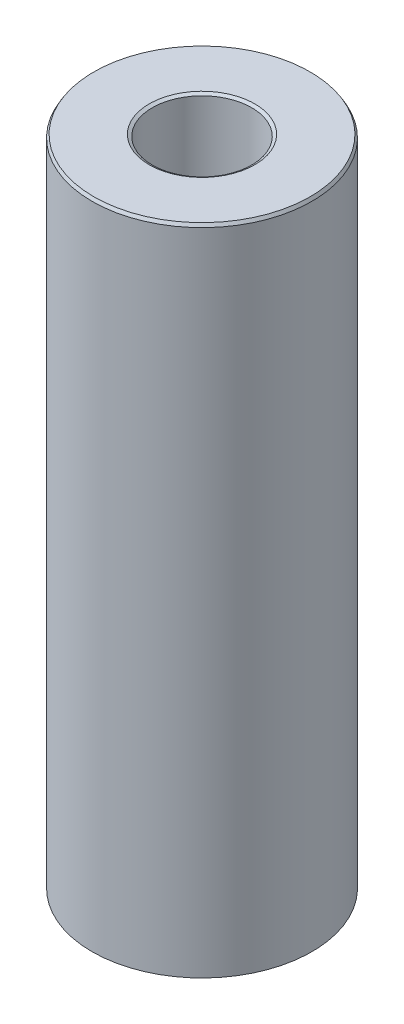
ISO-10303-21;
HEADER;
FILE_DESCRIPTION(('STEP AP214'),'2;1');
FILE_NAME('part.step','',(''),(''),'','','');
FILE_SCHEMA(('AUTOMOTIVE_DESIGN { 1 0 10303 214 1 1 1 1 }'));
ENDSEC;
DATA;
#1=APPLICATION_CONTEXT('core data for automotive mechanical design processes');
#2=APPLICATION_PROTOCOL_DEFINITION('international standard','automotive_design',2000,#1);
#3=PRODUCT_CONTEXT('',#1,'mechanical');
#4=PRODUCT('Part','Part','',(#3));
#5=PRODUCT_RELATED_PRODUCT_CATEGORY('part','',(#4));
#6=PRODUCT_DEFINITION_FORMATION('','',#4);
#7=PRODUCT_DEFINITION_CONTEXT('part definition',#1,'design');
#8=PRODUCT_DEFINITION('design','',#6,#7);
#9=PRODUCT_DEFINITION_SHAPE('','',#8);
#10=(LENGTH_UNIT() NAMED_UNIT(*) SI_UNIT(.MILLI.,.METRE.));
#11=(NAMED_UNIT(*) PLANE_ANGLE_UNIT() SI_UNIT($,.RADIAN.));
#12=(NAMED_UNIT(*) SI_UNIT($,.STERADIAN.) SOLID_ANGLE_UNIT());
#13=UNCERTAINTY_MEASURE_WITH_UNIT(LENGTH_MEASURE(1.E-05),#10,'distance_accuracy_value','');
#14=(GEOMETRIC_REPRESENTATION_CONTEXT(3) GLOBAL_UNCERTAINTY_ASSIGNED_CONTEXT((#13)) GLOBAL_UNIT_ASSIGNED_CONTEXT((#10,
#11,#12)) REPRESENTATION_CONTEXT('',''));
#15=CARTESIAN_POINT('',(0.,0.,0.));
#16=DIRECTION('',(0.,0.,1.));
#17=DIRECTION('',(1.,0.,0.));
#18=AXIS2_PLACEMENT_3D('',#15,#16,#17);
#19=CARTESIAN_POINT('',(0.,74.4313332997931,0.));
#20=DIRECTION('',(0.,-1.,0.));
#21=DIRECTION('',(0.,0.,-1.));
#22=AXIS2_PLACEMENT_3D('',#19,#20,#21);
#23=CYLINDRICAL_SURFACE('',#22,12.5);
#24=CARTESIAN_POINT('',(0.,0.202127398570007,0.));
#25=DIRECTION('',(0.,1.,0.));
#26=DIRECTION('',(0.,0.,1.));
#27=AXIS2_PLACEMENT_3D('',#24,#25,#26);
#28=CIRCLE('',#27,12.5);
#29=CARTESIAN_POINT('',(0.,0.202127398570007,12.5));
#30=VERTEX_POINT('',#29);
#31=EDGE_CURVE('E10',#30,#30,#28,.T.);
#32=ORIENTED_EDGE('',*,*,#31,.T.);
#33=EDGE_LOOP('',(#32));
#34=FACE_BOUND('',#33,.T.);
#35=CARTESIAN_POINT('',(0.,74.0812383758682,0.));
#36=DIRECTION('',(0.,1.,0.));
#37=DIRECTION('',(0.,0.,1.));
#38=AXIS2_PLACEMENT_3D('',#35,#36,#37);
#39=CIRCLE('',#38,12.5);
#40=CARTESIAN_POINT('',(0.,74.0812383758682,12.5));
#41=VERTEX_POINT('',#40);
#42=EDGE_CURVE('E50',#41,#41,#39,.F.);
#43=ORIENTED_EDGE('',*,*,#42,.T.);
#44=EDGE_LOOP('',(#43));
#45=FACE_BOUND('',#44,.T.);
#46=ADVANCED_FACE('F39',(#34,#45),#23,.T.);
#47=CARTESIAN_POINT('',(0.,74.4313332997931,0.));
#48=DIRECTION('',(0.,1.,0.));
#49=DIRECTION('',(0.,0.,1.));
#50=AXIS2_PLACEMENT_3D('',#47,#48,#49);
#51=PLANE('',#50);
#52=CARTESIAN_POINT('',(0.,74.4313332997931,0.));
#53=DIRECTION('',(0.,1.,0.));
#54=DIRECTION('',(0.,0.,1.));
#55=AXIS2_PLACEMENT_3D('',#52,#53,#54);
#56=CIRCLE('',#55,6.00171155576419);
#57=CARTESIAN_POINT('',(0.,74.4313332997931,6.00171155576419));
#58=VERTEX_POINT('',#57);
#59=EDGE_CURVE('E58',#58,#58,#56,.F.);
#60=ORIENTED_EDGE('',*,*,#59,.T.);
#61=EDGE_LOOP('',(#60));
#62=FACE_BOUND('',#61,.T.);
#63=CARTESIAN_POINT('',(0.,74.4313332997931,0.));
#64=DIRECTION('',(0.,1.,0.));
#65=DIRECTION('',(0.,0.,1.));
#66=AXIS2_PLACEMENT_3D('',#63,#64,#65);
#67=CIRCLE('',#66,12.29787260143);
#68=CARTESIAN_POINT('',(0.,74.4313332997931,12.29787260143));
#69=VERTEX_POINT('',#68);
#70=EDGE_CURVE('E61',#69,#69,#67,.T.);
#71=ORIENTED_EDGE('',*,*,#70,.T.);
#72=EDGE_LOOP('',(#71));
#73=FACE_BOUND('',#72,.T.);
#74=ADVANCED_FACE('F88',(#62,#73),#51,.T.);
#75=CARTESIAN_POINT('',(0.,0.,0.));
#76=DIRECTION('',(0.,1.,0.));
#77=DIRECTION('',(0.,0.,1.));
#78=AXIS2_PLACEMENT_3D('',#75,#76,#77);
#79=PLANE('',#78);
#80=CARTESIAN_POINT('',(0.,0.,0.));
#81=DIRECTION('',(0.,1.,0.));
#82=DIRECTION('',(0.,0.,1.));
#83=AXIS2_PLACEMENT_3D('',#80,#81,#82);
#84=CIRCLE('',#83,5.85374403040922);
#85=CARTESIAN_POINT('',(0.,0.,5.85374403040922));
#86=VERTEX_POINT('',#85);
#87=EDGE_CURVE('E51',#86,#86,#84,.T.);
#88=ORIENTED_EDGE('',*,*,#87,.T.);
#89=EDGE_LOOP('',(#88));
#90=FACE_BOUND('',#89,.T.);
#91=CARTESIAN_POINT('',(0.,0.,0.));
#92=DIRECTION('',(0.,1.,0.));
#93=DIRECTION('',(0.,0.,1.));
#94=AXIS2_PLACEMENT_3D('',#91,#92,#93);
#95=CIRCLE('',#94,12.149905076075);
#96=CARTESIAN_POINT('',(0.,0.,12.149905076075));
#97=VERTEX_POINT('',#96);
#98=EDGE_CURVE('E54',#97,#97,#95,.F.);
#99=ORIENTED_EDGE('',*,*,#98,.T.);
#100=EDGE_LOOP('',(#99));
#101=FACE_BOUND('',#100,.T.);
#102=ADVANCED_FACE('F83',(#90,#101),#79,.F.);
#103=CARTESIAN_POINT('',(0.,74.4313332997931,0.));
#104=DIRECTION('',(0.,-1.,0.));
#105=DIRECTION('',(0.,0.,-1.));
#106=AXIS2_PLACEMENT_3D('',#103,#104,#105);
#107=CYLINDRICAL_SURFACE('',#106,5.65161663183922);
#108=CARTESIAN_POINT('',(0.,74.2292059012231,0.));
#109=DIRECTION('',(0.,1.,0.));
#110=DIRECTION('',(0.,0.,1.));
#111=AXIS2_PLACEMENT_3D('',#108,#109,#110);
#112=CIRCLE('',#111,5.65161663183922);
#113=CARTESIAN_POINT('',(0.,74.2292059012231,5.65161663183922));
#114=VERTEX_POINT('',#113);
#115=EDGE_CURVE('E67',#114,#114,#112,.T.);
#116=ORIENTED_EDGE('',*,*,#115,.T.);
#117=EDGE_LOOP('',(#116));
#118=FACE_BOUND('',#117,.T.);
#119=CARTESIAN_POINT('',(0.,0.35009492392496,0.));
#120=DIRECTION('',(0.,1.,0.));
#121=DIRECTION('',(0.,0.,1.));
#122=AXIS2_PLACEMENT_3D('',#119,#120,#121);
#123=CIRCLE('',#122,5.65161663183922);
#124=CARTESIAN_POINT('',(0.,0.35009492392496,5.65161663183922));
#125=VERTEX_POINT('',#124);
#126=EDGE_CURVE('E69',#125,#125,#123,.F.);
#127=ORIENTED_EDGE('',*,*,#126,.T.);
#128=EDGE_LOOP('',(#127));
#129=FACE_BOUND('',#128,.T.);
#130=ADVANCED_FACE('F71',(#118,#129),#107,.F.);
#131=CARTESIAN_POINT('',(0.,74.2292059012231,0.));
#132=DIRECTION('',(0.,1.,0.));
#133=DIRECTION('',(0.,0.,1.));
#134=AXIS2_PLACEMENT_3D('',#131,#132,#133);
#135=CONICAL_SURFACE('',#134,5.65161663183922,1.04719755119659);
#136=ORIENTED_EDGE('',*,*,#59,.F.);
#137=EDGE_LOOP('',(#136));
#138=FACE_BOUND('',#137,.T.);
#139=ORIENTED_EDGE('',*,*,#115,.F.);
#140=EDGE_LOOP('',(#139));
#141=FACE_BOUND('',#140,.T.);
#142=ADVANCED_FACE('F77',(#138,#141),#135,.F.);
#143=CARTESIAN_POINT('',(0.,0.,0.));
#144=DIRECTION('',(0.,-1.,0.));
#145=DIRECTION('',(0.,0.,-1.));
#146=AXIS2_PLACEMENT_3D('',#143,#144,#145);
#147=CONICAL_SURFACE('',#146,5.85374403040922,0.523598775598316);
#148=ORIENTED_EDGE('',*,*,#126,.F.);
#149=EDGE_LOOP('',(#148));
#150=FACE_BOUND('',#149,.T.);
#151=ORIENTED_EDGE('',*,*,#87,.F.);
#152=EDGE_LOOP('',(#151));
#153=FACE_BOUND('',#152,.T.);
#154=ADVANCED_FACE('F73',(#150,#153),#147,.F.);
#155=CARTESIAN_POINT('',(0.,0.202127398570007,0.));
#156=DIRECTION('',(0.,1.,0.));
#157=DIRECTION('',(0.,0.,1.));
#158=AXIS2_PLACEMENT_3D('',#155,#156,#157);
#159=CONICAL_SURFACE('',#158,12.5,1.04719755119659);
#160=ORIENTED_EDGE('',*,*,#98,.F.);
#161=EDGE_LOOP('',(#160));
#162=FACE_BOUND('',#161,.T.);
#163=ORIENTED_EDGE('',*,*,#31,.F.);
#164=EDGE_LOOP('',(#163));
#165=FACE_BOUND('',#164,.T.);
#166=ADVANCED_FACE('F76',(#162,#165),#159,.T.);
#167=CARTESIAN_POINT('',(0.,74.4313332997931,0.));
#168=DIRECTION('',(0.,-1.,0.));
#169=DIRECTION('',(0.,0.,-1.));
#170=AXIS2_PLACEMENT_3D('',#167,#168,#169);
#171=CONICAL_SURFACE('',#170,12.29787260143,0.523598775598285);
#172=ORIENTED_EDGE('',*,*,#42,.F.);
#173=EDGE_LOOP('',(#172));
#174=FACE_BOUND('',#173,.T.);
#175=ORIENTED_EDGE('',*,*,#70,.F.);
#176=EDGE_LOOP('',(#175));
#177=FACE_BOUND('',#176,.T.);
#178=ADVANCED_FACE('F45',(#174,#177),#171,.T.);
#179=CLOSED_SHELL('',(#46,#74,#102,#130,#142,#154,#166,#178));
#180=MANIFOLD_SOLID_BREP('B2',#179);
#181=ADVANCED_BREP_SHAPE_REPRESENTATION('',(#18,#180),#14);
#182=SHAPE_DEFINITION_REPRESENTATION(#9,#181);
ENDSEC;
END-ISO-10303-21;
